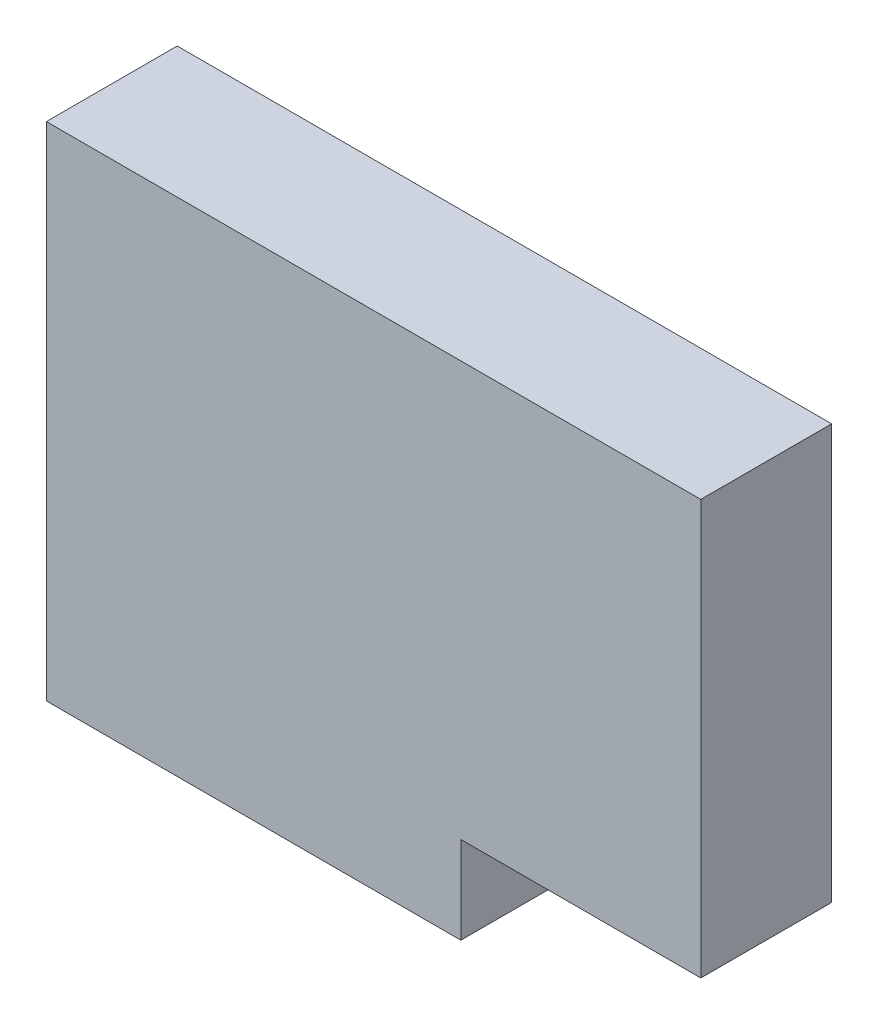
ISO-10303-21;
HEADER;
FILE_DESCRIPTION(('STEP AP214'),'2;1');
FILE_NAME('part.step','',(''),(''),'','','');
FILE_SCHEMA(('AUTOMOTIVE_DESIGN { 1 0 10303 214 1 1 1 1 }'));
ENDSEC;
DATA;
#1=APPLICATION_CONTEXT('core data for automotive mechanical design processes');
#2=APPLICATION_PROTOCOL_DEFINITION('international standard','automotive_design',2000,#1);
#3=PRODUCT_CONTEXT('',#1,'mechanical');
#4=PRODUCT('Part','Part','',(#3));
#5=PRODUCT_RELATED_PRODUCT_CATEGORY('part','',(#4));
#6=PRODUCT_DEFINITION_FORMATION('','',#4);
#7=PRODUCT_DEFINITION_CONTEXT('part definition',#1,'design');
#8=PRODUCT_DEFINITION('design','',#6,#7);
#9=PRODUCT_DEFINITION_SHAPE('','',#8);
#10=(LENGTH_UNIT() NAMED_UNIT(*) SI_UNIT(.MILLI.,.METRE.));
#11=(NAMED_UNIT(*) PLANE_ANGLE_UNIT() SI_UNIT($,.RADIAN.));
#12=(NAMED_UNIT(*) SI_UNIT($,.STERADIAN.) SOLID_ANGLE_UNIT());
#13=UNCERTAINTY_MEASURE_WITH_UNIT(LENGTH_MEASURE(1.E-05),#10,'distance_accuracy_value','');
#14=(GEOMETRIC_REPRESENTATION_CONTEXT(3) GLOBAL_UNCERTAINTY_ASSIGNED_CONTEXT((#13)) GLOBAL_UNIT_ASSIGNED_CONTEXT((#10,
#11,#12)) REPRESENTATION_CONTEXT('',''));
#15=CARTESIAN_POINT('',(0.,0.,0.));
#16=DIRECTION('',(0.,0.,1.));
#17=DIRECTION('',(1.,0.,0.));
#18=AXIS2_PLACEMENT_3D('',#15,#16,#17);
#19=CARTESIAN_POINT('',(381.,-292.1,152.4));
#20=DIRECTION('',(-1.,0.,0.));
#21=DIRECTION('',(0.,0.,1.));
#22=AXIS2_PLACEMENT_3D('',#19,#20,#21);
#23=PLANE('',#22);
#24=DIRECTION('',(0.,1.,0.));
#25=VECTOR('',#24,1.);
#26=CARTESIAN_POINT('',(381.,-292.1,152.4));
#27=LINE('',#26,#25);
#28=CARTESIAN_POINT('',(381.,-190.5,152.4));
#29=VERTEX_POINT('',#28);
#30=CARTESIAN_POINT('',(381.,292.1,152.4));
#31=VERTEX_POINT('',#30);
#32=EDGE_CURVE('E78',#29,#31,#27,.T.);
#33=ORIENTED_EDGE('',*,*,#32,.F.);
#34=DIRECTION('',(0.,0.,1.));
#35=VECTOR('',#34,1.);
#36=CARTESIAN_POINT('',(381.,-190.5,0.));
#37=LINE('',#36,#35);
#38=CARTESIAN_POINT('',(381.,-190.5,0.));
#39=VERTEX_POINT('',#38);
#40=EDGE_CURVE('E98',#39,#29,#37,.T.);
#41=ORIENTED_EDGE('',*,*,#40,.F.);
#42=DIRECTION('',(0.,1.,0.));
#43=VECTOR('',#42,1.);
#44=CARTESIAN_POINT('',(381.,-292.1,0.));
#45=LINE('',#44,#43);
#46=CARTESIAN_POINT('',(381.,292.1,0.));
#47=VERTEX_POINT('',#46);
#48=EDGE_CURVE('E106',#39,#47,#45,.T.);
#49=ORIENTED_EDGE('',*,*,#48,.T.);
#50=DIRECTION('',(0.,0.,-1.));
#51=VECTOR('',#50,1.);
#52=CARTESIAN_POINT('',(381.,292.1,152.4));
#53=LINE('',#52,#51);
#54=EDGE_CURVE('E11',#31,#47,#53,.T.);
#55=ORIENTED_EDGE('',*,*,#54,.F.);
#56=EDGE_LOOP('',(#33,#41,#49,#55));
#57=FACE_BOUND('',#56,.T.);
#58=ADVANCED_FACE('F33',(#57),#23,.F.);
#59=CARTESIAN_POINT('',(-381.,292.1,152.4));
#60=DIRECTION('',(0.,-1.,0.));
#61=DIRECTION('',(0.,0.,-1.));
#62=AXIS2_PLACEMENT_3D('',#59,#60,#61);
#63=PLANE('',#62);
#64=DIRECTION('',(-1.,0.,0.));
#65=VECTOR('',#64,1.);
#66=CARTESIAN_POINT('',(-381.,292.1,0.));
#67=LINE('',#66,#65);
#68=CARTESIAN_POINT('',(-381.,292.1,0.));
#69=VERTEX_POINT('',#68);
#70=EDGE_CURVE('E110',#47,#69,#67,.T.);
#71=ORIENTED_EDGE('',*,*,#70,.T.);
#72=DIRECTION('',(0.,0.,-1.));
#73=VECTOR('',#72,1.);
#74=CARTESIAN_POINT('',(-381.,292.1,152.4));
#75=LINE('',#74,#73);
#76=CARTESIAN_POINT('',(-381.,292.1,152.4));
#77=VERTEX_POINT('',#76);
#78=EDGE_CURVE('E40',#77,#69,#75,.T.);
#79=ORIENTED_EDGE('',*,*,#78,.F.);
#80=DIRECTION('',(-1.,0.,0.));
#81=VECTOR('',#80,1.);
#82=CARTESIAN_POINT('',(-381.,292.1,152.4));
#83=LINE('',#82,#81);
#84=EDGE_CURVE('E133',#31,#77,#83,.T.);
#85=ORIENTED_EDGE('',*,*,#84,.F.);
#86=ORIENTED_EDGE('',*,*,#54,.T.);
#87=EDGE_LOOP('',(#71,#79,#85,#86));
#88=FACE_BOUND('',#87,.T.);
#89=ADVANCED_FACE('F152',(#88),#63,.F.);
#90=CARTESIAN_POINT('',(-381.,-292.1,152.4));
#91=DIRECTION('',(1.,0.,0.));
#92=DIRECTION('',(0.,0.,-1.));
#93=AXIS2_PLACEMENT_3D('',#90,#91,#92);
#94=PLANE('',#93);
#95=DIRECTION('',(0.,-1.,0.));
#96=VECTOR('',#95,1.);
#97=CARTESIAN_POINT('',(-381.,-292.1,0.));
#98=LINE('',#97,#96);
#99=CARTESIAN_POINT('',(-381.,-292.1,0.));
#100=VERTEX_POINT('',#99);
#101=EDGE_CURVE('E73',#69,#100,#98,.T.);
#102=ORIENTED_EDGE('',*,*,#101,.T.);
#103=DIRECTION('',(0.,0.,-1.));
#104=VECTOR('',#103,1.);
#105=CARTESIAN_POINT('',(-381.,-292.1,152.4));
#106=LINE('',#105,#104);
#107=CARTESIAN_POINT('',(-381.,-292.1,152.4));
#108=VERTEX_POINT('',#107);
#109=EDGE_CURVE('E124',#108,#100,#106,.T.);
#110=ORIENTED_EDGE('',*,*,#109,.F.);
#111=DIRECTION('',(0.,-1.,0.));
#112=VECTOR('',#111,1.);
#113=CARTESIAN_POINT('',(-381.,-292.1,152.4));
#114=LINE('',#113,#112);
#115=EDGE_CURVE('E56',#77,#108,#114,.T.);
#116=ORIENTED_EDGE('',*,*,#115,.F.);
#117=ORIENTED_EDGE('',*,*,#78,.T.);
#118=EDGE_LOOP('',(#102,#110,#116,#117));
#119=FACE_BOUND('',#118,.T.);
#120=ADVANCED_FACE('F126',(#119),#94,.F.);
#121=CARTESIAN_POINT('',(-381.,-292.1,152.4));
#122=DIRECTION('',(0.,1.,0.));
#123=DIRECTION('',(0.,0.,1.));
#124=AXIS2_PLACEMENT_3D('',#121,#122,#123);
#125=PLANE('',#124);
#126=DIRECTION('',(1.,0.,0.));
#127=VECTOR('',#126,1.);
#128=CARTESIAN_POINT('',(-381.,-292.1,0.));
#129=LINE('',#128,#127);
#130=CARTESIAN_POINT('',(101.6,-292.1,0.));
#131=VERTEX_POINT('',#130);
#132=EDGE_CURVE('E121',#100,#131,#129,.T.);
#133=ORIENTED_EDGE('',*,*,#132,.T.);
#134=DIRECTION('',(0.,0.,1.));
#135=VECTOR('',#134,1.);
#136=CARTESIAN_POINT('',(101.6,-292.1,0.));
#137=LINE('',#136,#135);
#138=CARTESIAN_POINT('',(101.6,-292.1,152.4));
#139=VERTEX_POINT('',#138);
#140=EDGE_CURVE('E111',#131,#139,#137,.T.);
#141=ORIENTED_EDGE('',*,*,#140,.T.);
#142=DIRECTION('',(1.,0.,0.));
#143=VECTOR('',#142,1.);
#144=CARTESIAN_POINT('',(-381.,-292.1,152.4));
#145=LINE('',#144,#143);
#146=EDGE_CURVE('E117',#108,#139,#145,.T.);
#147=ORIENTED_EDGE('',*,*,#146,.F.);
#148=ORIENTED_EDGE('',*,*,#109,.T.);
#149=EDGE_LOOP('',(#133,#141,#147,#148));
#150=FACE_BOUND('',#149,.T.);
#151=ADVANCED_FACE('F130',(#150),#125,.F.);
#152=CARTESIAN_POINT('',(0.,0.,152.4));
#153=DIRECTION('',(0.,0.,-1.));
#154=DIRECTION('',(-1.,0.,0.));
#155=AXIS2_PLACEMENT_3D('',#152,#153,#154);
#156=PLANE('',#155);
#157=ORIENTED_EDGE('',*,*,#146,.T.);
#158=DIRECTION('',(0.,-1.,0.));
#159=VECTOR('',#158,1.);
#160=CARTESIAN_POINT('',(101.6,-292.1,152.4));
#161=LINE('',#160,#159);
#162=CARTESIAN_POINT('',(101.6,-190.5,152.4));
#163=VERTEX_POINT('',#162);
#164=EDGE_CURVE('E102',#163,#139,#161,.T.);
#165=ORIENTED_EDGE('',*,*,#164,.F.);
#166=DIRECTION('',(-1.,0.,0.));
#167=VECTOR('',#166,1.);
#168=CARTESIAN_POINT('',(381.,-190.5,152.4));
#169=LINE('',#168,#167);
#170=EDGE_CURVE('E139',#29,#163,#169,.T.);
#171=ORIENTED_EDGE('',*,*,#170,.F.);
#172=ORIENTED_EDGE('',*,*,#32,.T.);
#173=ORIENTED_EDGE('',*,*,#84,.T.);
#174=ORIENTED_EDGE('',*,*,#115,.T.);
#175=EDGE_LOOP('',(#157,#165,#171,#172,#173,#174));
#176=FACE_BOUND('',#175,.T.);
#177=ADVANCED_FACE('F141',(#176),#156,.F.);
#178=CARTESIAN_POINT('',(0.,0.,0.));
#179=DIRECTION('',(0.,0.,-1.));
#180=DIRECTION('',(-1.,0.,0.));
#181=AXIS2_PLACEMENT_3D('',#178,#179,#180);
#182=PLANE('',#181);
#183=DIRECTION('',(0.,-1.,0.));
#184=VECTOR('',#183,1.);
#185=CARTESIAN_POINT('',(101.6,-292.1,0.));
#186=LINE('',#185,#184);
#187=CARTESIAN_POINT('',(101.6,-190.5,0.));
#188=VERTEX_POINT('',#187);
#189=EDGE_CURVE('E47',#188,#131,#186,.T.);
#190=ORIENTED_EDGE('',*,*,#189,.T.);
#191=ORIENTED_EDGE('',*,*,#132,.F.);
#192=ORIENTED_EDGE('',*,*,#101,.F.);
#193=ORIENTED_EDGE('',*,*,#70,.F.);
#194=ORIENTED_EDGE('',*,*,#48,.F.);
#195=DIRECTION('',(-1.,0.,0.));
#196=VECTOR('',#195,1.);
#197=CARTESIAN_POINT('',(381.,-190.5,0.));
#198=LINE('',#197,#196);
#199=EDGE_CURVE('E94',#39,#188,#198,.T.);
#200=ORIENTED_EDGE('',*,*,#199,.T.);
#201=EDGE_LOOP('',(#190,#191,#192,#193,#194,#200));
#202=FACE_BOUND('',#201,.T.);
#203=ADVANCED_FACE('F109',(#202),#182,.T.);
#204=CARTESIAN_POINT('',(101.6,-292.1,0.));
#205=DIRECTION('',(-1.,0.,0.));
#206=DIRECTION('',(0.,0.,1.));
#207=AXIS2_PLACEMENT_3D('',#204,#205,#206);
#208=PLANE('',#207);
#209=ORIENTED_EDGE('',*,*,#164,.T.);
#210=ORIENTED_EDGE('',*,*,#140,.F.);
#211=ORIENTED_EDGE('',*,*,#189,.F.);
#212=DIRECTION('',(0.,0.,1.));
#213=VECTOR('',#212,1.);
#214=CARTESIAN_POINT('',(101.6,-190.5,0.));
#215=LINE('',#214,#213);
#216=EDGE_CURVE('E99',#188,#163,#215,.T.);
#217=ORIENTED_EDGE('',*,*,#216,.T.);
#218=EDGE_LOOP('',(#209,#210,#211,#217));
#219=FACE_BOUND('',#218,.T.);
#220=ADVANCED_FACE('F142',(#219),#208,.F.);
#221=CARTESIAN_POINT('',(381.,-190.5,0.));
#222=DIRECTION('',(0.,1.,0.));
#223=DIRECTION('',(-1.,0.,0.));
#224=AXIS2_PLACEMENT_3D('',#221,#222,#223);
#225=PLANE('',#224);
#226=ORIENTED_EDGE('',*,*,#170,.T.);
#227=ORIENTED_EDGE('',*,*,#216,.F.);
#228=ORIENTED_EDGE('',*,*,#199,.F.);
#229=ORIENTED_EDGE('',*,*,#40,.T.);
#230=EDGE_LOOP('',(#226,#227,#228,#229));
#231=FACE_BOUND('',#230,.T.);
#232=ADVANCED_FACE('F97',(#231),#225,.F.);
#233=CLOSED_SHELL('',(#58,#89,#120,#151,#177,#203,#220,#232));
#234=MANIFOLD_SOLID_BREP('B2',#233);
#235=ADVANCED_BREP_SHAPE_REPRESENTATION('',(#18,#234),#14);
#236=SHAPE_DEFINITION_REPRESENTATION(#9,#235);
ENDSEC;
END-ISO-10303-21;
